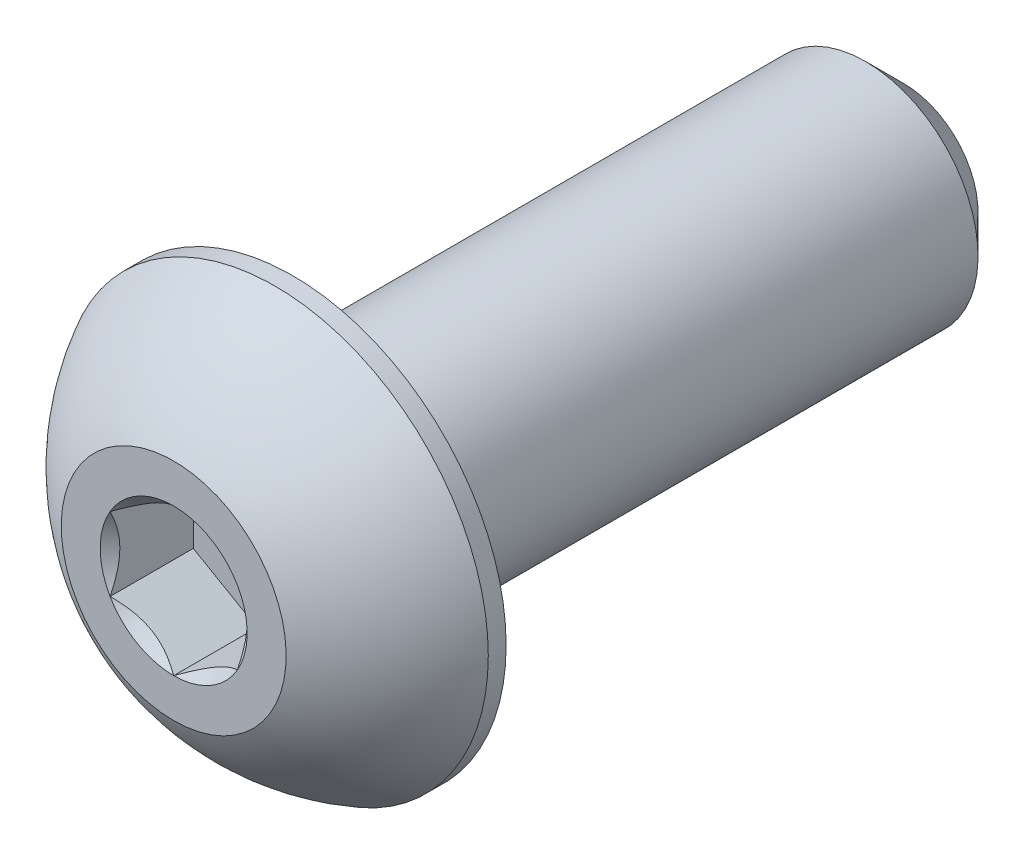
ISO-10303-21;
HEADER;
FILE_DESCRIPTION(('STEP AP214'),'2;1');
FILE_NAME('part.step','',(''),(''),'','','');
FILE_SCHEMA(('AUTOMOTIVE_DESIGN { 1 0 10303 214 1 1 1 1 }'));
ENDSEC;
DATA;
#1=APPLICATION_CONTEXT('core data for automotive mechanical design processes');
#2=APPLICATION_PROTOCOL_DEFINITION('international standard','automotive_design',2000,#1);
#3=PRODUCT_CONTEXT('',#1,'mechanical');
#4=PRODUCT('Part','Part','',(#3));
#5=PRODUCT_RELATED_PRODUCT_CATEGORY('part','',(#4));
#6=PRODUCT_DEFINITION_FORMATION('','',#4);
#7=PRODUCT_DEFINITION_CONTEXT('part definition',#1,'design');
#8=PRODUCT_DEFINITION('design','',#6,#7);
#9=PRODUCT_DEFINITION_SHAPE('','',#8);
#10=(LENGTH_UNIT() NAMED_UNIT(*) SI_UNIT(.MILLI.,.METRE.));
#11=(NAMED_UNIT(*) PLANE_ANGLE_UNIT() SI_UNIT($,.RADIAN.));
#12=(NAMED_UNIT(*) SI_UNIT($,.STERADIAN.) SOLID_ANGLE_UNIT());
#13=UNCERTAINTY_MEASURE_WITH_UNIT(LENGTH_MEASURE(1.E-05),#10,'distance_accuracy_value','');
#14=(GEOMETRIC_REPRESENTATION_CONTEXT(3) GLOBAL_UNCERTAINTY_ASSIGNED_CONTEXT((#13)) GLOBAL_UNIT_ASSIGNED_CONTEXT((#10,
#11,#12)) REPRESENTATION_CONTEXT('',''));
#15=CARTESIAN_POINT('',(0.,0.,0.));
#16=DIRECTION('',(0.,0.,1.));
#17=DIRECTION('',(1.,0.,0.));
#18=AXIS2_PLACEMENT_3D('',#15,#16,#17);
#19=CARTESIAN_POINT('',(0.,-1.75260000000001,-11.3792));
#20=DIRECTION('',(0.,0.,-1.));
#21=DIRECTION('',(0.,1.,0.));
#22=AXIS2_PLACEMENT_3D('',#19,#20,#21);
#23=PLANE('',#22);
#24=CARTESIAN_POINT('',(0.,0.,-11.3792));
#25=DIRECTION('',(0.,0.,-1.));
#26=DIRECTION('',(0.,1.,0.));
#27=AXIS2_PLACEMENT_3D('',#24,#25,#26);
#28=CIRCLE('',#27,1.1572875);
#29=CARTESIAN_POINT('',(0.,1.1572875,-11.3792));
#30=VERTEX_POINT('',#29);
#31=EDGE_CURVE('E176',#30,#30,#28,.T.);
#32=ORIENTED_EDGE('',*,*,#31,.T.);
#33=EDGE_LOOP('',(#32));
#34=FACE_BOUND('',#33,.T.);
#35=ADVANCED_FACE('F36',(#34),#23,.T.);
#36=CARTESIAN_POINT('',(0.,0.,-11.3792));
#37=DIRECTION('',(0.,0.,-1.));
#38=DIRECTION('',(0.,1.,0.));
#39=AXIS2_PLACEMENT_3D('',#36,#37,#38);
#40=CYLINDRICAL_SURFACE('',#39,1.7526);
#41=CARTESIAN_POINT('',(0.,0.,-10.7838875));
#42=DIRECTION('',(0.,0.,-1.));
#43=DIRECTION('',(0.,1.,0.));
#44=AXIS2_PLACEMENT_3D('',#41,#42,#43);
#45=CIRCLE('',#44,1.7526);
#46=CARTESIAN_POINT('',(0.,1.7526,-10.7838875));
#47=VERTEX_POINT('',#46);
#48=EDGE_CURVE('E50',#47,#47,#45,.F.);
#49=ORIENTED_EDGE('',*,*,#48,.T.);
#50=EDGE_LOOP('',(#49));
#51=FACE_BOUND('',#50,.T.);
#52=CARTESIAN_POINT('',(0.,0.,-1.8542));
#53=DIRECTION('',(0.,0.,1.));
#54=DIRECTION('',(1.,0.,0.));
#55=AXIS2_PLACEMENT_3D('',#52,#53,#54);
#56=CIRCLE('',#55,1.7526);
#57=CARTESIAN_POINT('',(1.7526,0.,-1.8542));
#58=VERTEX_POINT('',#57);
#59=EDGE_CURVE('E173',#58,#58,#56,.F.);
#60=ORIENTED_EDGE('',*,*,#59,.T.);
#61=EDGE_LOOP('',(#60));
#62=FACE_BOUND('',#61,.T.);
#63=ADVANCED_FACE('F181',(#51,#62),#40,.T.);
#64=CARTESIAN_POINT('',(0.,0.,-11.3792));
#65=DIRECTION('',(0.,0.,1.));
#66=DIRECTION('',(0.,-1.,0.));
#67=AXIS2_PLACEMENT_3D('',#64,#65,#66);
#68=CONICAL_SURFACE('',#67,1.1572875,0.785398163397445);
#69=ORIENTED_EDGE('',*,*,#48,.F.);
#70=EDGE_LOOP('',(#69));
#71=FACE_BOUND('',#70,.T.);
#72=ORIENTED_EDGE('',*,*,#31,.F.);
#73=EDGE_LOOP('',(#72));
#74=FACE_BOUND('',#73,.T.);
#75=ADVANCED_FACE('F38',(#71,#74),#68,.T.);
#76=CARTESIAN_POINT('',(0.,0.,-3.32598826349718));
#77=DIRECTION('',(0.,0.,1.));
#78=DIRECTION('',(0.,-1.,0.));
#79=AXIS2_PLACEMENT_3D('',#76,#77,#78);
#80=SPHERICAL_SURFACE('',#79,3.75949527050121);
#81=CARTESIAN_POINT('',(0.,0.,0.));
#82=DIRECTION('',(0.,0.,1.));
#83=DIRECTION('',(1.,0.,0.));
#84=AXIS2_PLACEMENT_3D('',#81,#82,#83);
#85=CIRCLE('',#84,1.7526);
#86=CARTESIAN_POINT('',(0.,-1.7526,0.));
#87=VERTEX_POINT('',#86);
#88=EDGE_CURVE('E170',#87,#87,#85,.T.);
#89=CARTESIAN_POINT('',(0.,0.,-1.57607));
#90=DIRECTION('',(0.,0.,1.));
#91=DIRECTION('',(1.,0.,0.));
#92=AXIS2_PLACEMENT_3D('',#89,#90,#91);
#93=CIRCLE('',#92,3.3274);
#94=CARTESIAN_POINT('',(0.,-3.3274,-1.57607));
#95=VERTEX_POINT('',#94);
#96=EDGE_CURVE('E164',#95,#95,#93,.T.);
#97=CARTESIAN_POINT('',(0.,-1.7526,0.));
#98=CARTESIAN_POINT('',(0.,-1.77344521091166,-0.0109841671242036));
#99=CARTESIAN_POINT('',(0.,-1.79418713228591,-0.022164349509344));
#100=CARTESIAN_POINT('',(0.,-1.83545712312919,-0.0449126843404111));
#101=CARTESIAN_POINT('',(0.,-1.85598519259822,-0.0564808367863379));
#102=CARTESIAN_POINT('',(0.,-1.89682020680057,-0.0800010512778902));
#103=CARTESIAN_POINT('',(0.,-1.9171271515339,-0.0919531133235157));
#104=CARTESIAN_POINT('',(0.,-1.95751274186056,-0.116236914088468));
#105=CARTESIAN_POINT('',(0.,-1.97759138745388,-0.128568652807795));
#106=CARTESIAN_POINT('',(0.,-2.01751328037423,-0.15360744962207));
#107=CARTESIAN_POINT('',(0.,-2.03735652770125,-0.166314507717019));
#108=CARTESIAN_POINT('',(0.,-2.07680060963244,-0.192099450667238));
#109=CARTESIAN_POINT('',(0.,-2.09640144423661,-0.205177335522508));
#110=CARTESIAN_POINT('',(0.,-2.13535377157089,-0.231699308994505));
#111=CARTESIAN_POINT('',(0.,-2.15470526430101,-0.245143397611231));
#112=CARTESIAN_POINT('',(0.,-2.19315206698496,-0.27239302596156));
#113=CARTESIAN_POINT('',(0.,-2.2122473769388,-0.286198565695162));
#114=CARTESIAN_POINT('',(0.,-2.25017506370288,-0.314166215909251));
#115=CARTESIAN_POINT('',(0.,-2.26900744051313,-0.328328326389736));
#116=CARTESIAN_POINT('',(0.,-2.30640260357941,-0.357004111663073));
#117=CARTESIAN_POINT('',(0.,-2.32496538983544,-0.371517786455924));
#118=CARTESIAN_POINT('',(0.,-2.36181480968332,-0.400891569642019));
#119=CARTESIAN_POINT('',(0.,-2.38010144327516,-0.415751678035262));
#120=CARTESIAN_POINT('',(0.,-2.41639209330763,-0.44581307524184));
#121=CARTESIAN_POINT('',(0.,-2.43439610974826,-0.461014364055174));
#122=CARTESIAN_POINT('',(0.,-2.47011516089881,-0.491752748311591));
#123=CARTESIAN_POINT('',(0.,-2.48783019560872,-0.507289843754673));
#124=CARTESIAN_POINT('',(0.,-2.52296502087599,-0.538694348769551));
#125=CARTESIAN_POINT('',(0.,-2.54038481143333,-0.554561758341348));
#126=CARTESIAN_POINT('',(0.,-2.57492299034501,-0.586621282343664));
#127=CARTESIAN_POINT('',(0.,-2.59204137869935,-0.602813396774184));
#128=CARTESIAN_POINT('',(0.,-2.62597070170293,-0.635516606437908));
#129=CARTESIAN_POINT('',(0.,-2.64278163635217,-0.652027701671111));
#130=CARTESIAN_POINT('',(0.,-2.67609010913108,-0.685363036121617));
#131=CARTESIAN_POINT('',(0.,-2.69258764726075,-0.702187275338921));
#132=CARTESIAN_POINT('',(0.,-2.72526349497449,-0.736142950239869));
#133=CARTESIAN_POINT('',(0.,-2.74144180455856,-0.753274385923514));
#134=CARTESIAN_POINT('',(0.,-2.7734734760052,-0.787838397642713));
#135=CARTESIAN_POINT('',(0.,-2.78932683786777,-0.805270973678268));
#136=CARTESIAN_POINT('',(0.,-2.82070300956741,-0.840431103531066));
#137=CARTESIAN_POINT('',(0.,-2.83622581940447,-0.85815865734831));
#138=CARTESIAN_POINT('',(0.,-2.86693539960216,-0.893902475917015));
#139=CARTESIAN_POINT('',(0.,-2.88212216996277,-0.911918740668476));
#140=CARTESIAN_POINT('',(0.,-2.91215430254962,-0.94823361219623));
#141=CARTESIAN_POINT('',(0.,-2.92699966477584,-0.966532218972523));
#142=CARTESIAN_POINT('',(0.,-2.95634373312651,-1.00340530583029));
#143=CARTESIAN_POINT('',(0.,-2.97084243925094,-1.02197978591176));
#144=CARTESIAN_POINT('',(0.,-2.99948806997761,-1.05939805313605));
#145=CARTESIAN_POINT('',(0.,-3.01363499457984,-1.07824184027885));
#146=CARTESIAN_POINT('',(0.,-3.04157206119591,-1.11619206018152));
#147=CARTESIAN_POINT('',(0.,-3.05536220320976,-1.13529849294138));
#148=CARTESIAN_POINT('',(0.,-3.08258082972231,-1.17376724977885));
#149=CARTESIAN_POINT('',(0.,-3.09600931422102,-1.19312957385645));
#150=CARTESIAN_POINT('',(0.,-3.12249987857489,-1.23210326859816));
#151=CARTESIAN_POINT('',(0.,-3.13556195843005,-1.25171463926226));
#152=CARTESIAN_POINT('',(0.,-3.16131509608524,-1.29117949430132));
#153=CARTESIAN_POINT('',(0.,-3.17400615388527,-1.31103297867626));
#154=CARTESIAN_POINT('',(0.,-3.19901276047088,-1.3509750430611));
#155=CARTESIAN_POINT('',(0.,-3.21132830925647,-1.37106362307099));
#156=CARTESIAN_POINT('',(0.,-3.23557954623934,-1.4114687760892));
#157=CARTESIAN_POINT('',(0.,-3.24751523443662,-1.43178534909752));
#158=CARTESIAN_POINT('',(0.,-3.27100252310173,-1.47263931029833));
#159=CARTESIAN_POINT('',(0.,-3.28255412356956,-1.49317669849081));
#160=CARTESIAN_POINT('',(0.,-3.30526918217882,-1.53446501395862));
#161=CARTESIAN_POINT('',(0.,-3.31643264032025,-1.55521594123393));
#162=CARTESIAN_POINT('',(0.,-3.3274,-1.57607));
#163=B_SPLINE_CURVE_WITH_KNOTS('',3,(#97,#98,#99,#100,#101,#102,#103,#104,#105,#106,#107,#108,
#109,#110,#111,#112,#113,#114,#115,#116,#117,#118,#119,#120,#121,#122,#123,#124,#125,#126,#127,
#128,#129,#130,#131,#132,#133,#134,#135,#136,#137,#138,#139,#140,#141,#142,#143,#144,#145,#146,
#147,#148,#149,#150,#151,#152,#153,#154,#155,#156,#157,#158,#159,#160,#161,#162),.UNSPECIFIED.,
.F.,.F.,(4,2,2,2,2,2,2,2,2,2,2,2,2,2,2,2,2,2,2,2,2,2,2,2,2,2,2,2,2,2,2,2,4),(0.,
0.0706853966104395,0.141370793220879,0.212056189831318,0.282741586441757,0.353426983052197,
0.424112379662636,0.494797776273076,0.565483172883515,0.636168569493955,0.706853966104394,
0.777539362714834,0.848224759325273,0.918910155935712,0.989595552546151,1.06028094915659,
1.13096634576703,1.20165174237747,1.27233713898791,1.34302253559835,1.41370793220879,
1.48439332881923,1.55507872542967,1.62576412204011,1.69644951865055,1.76713491526098,
1.83782031187142,1.90850570848186,1.9791911050923,2.04987650170274,2.12056189831318,
2.19124729492362,2.26193269153406),.UNSPECIFIED.);
#164=EDGE_CURVE('BSEAM186',#87,#95,#163,.T.);
#165=ORIENTED_EDGE('',*,*,#88,.F.);
#166=ORIENTED_EDGE('',*,*,#96,.T.);
#167=ORIENTED_EDGE('',*,*,#164,.T.);
#168=ORIENTED_EDGE('',*,*,#164,.F.);
#169=EDGE_LOOP('',(#165,#167,#166,#168));
#170=FACE_BOUND('',#169,.T.);
#171=ADVANCED_FACE('F186',(#170),#80,.T.);
#172=CARTESIAN_POINT('',(0.,-1.7526,0.));
#173=DIRECTION('',(0.,0.,-1.));
#174=DIRECTION('',(-1.,0.,0.));
#175=AXIS2_PLACEMENT_3D('',#172,#173,#174);
#176=PLANE('',#175);
#177=CARTESIAN_POINT('',(0.,0.,0.));
#178=DIRECTION('',(0.,0.,1.));
#179=DIRECTION('',(1.,0.,0.));
#180=AXIS2_PLACEMENT_3D('',#177,#178,#179);
#181=CIRCLE('',#180,1.14567944042316);
#182=CARTESIAN_POINT('',(-0.9921875,0.572839720211582,0.));
#183=VERTEX_POINT('',#182);
#184=CARTESIAN_POINT('',(-0.9921875,-0.572839720211582,0.));
#185=VERTEX_POINT('',#184);
#186=EDGE_CURVE('E63',#183,#185,#181,.T.);
#187=ORIENTED_EDGE('',*,*,#186,.F.);
#188=CARTESIAN_POINT('',(0.,1.14567944042316,0.));
#189=VERTEX_POINT('',#188);
#190=EDGE_CURVE('E135',#189,#183,#181,.T.);
#191=ORIENTED_EDGE('',*,*,#190,.F.);
#192=CARTESIAN_POINT('',(0.9921875,0.572839720211582,0.));
#193=VERTEX_POINT('',#192);
#194=EDGE_CURVE('E132',#193,#189,#181,.T.);
#195=ORIENTED_EDGE('',*,*,#194,.F.);
#196=CARTESIAN_POINT('',(0.9921875,-0.572839720211582,0.));
#197=VERTEX_POINT('',#196);
#198=EDGE_CURVE('E103',#197,#193,#181,.T.);
#199=ORIENTED_EDGE('',*,*,#198,.F.);
#200=CARTESIAN_POINT('',(0.,-1.14567944042316,0.));
#201=VERTEX_POINT('',#200);
#202=EDGE_CURVE('E95',#201,#197,#181,.T.);
#203=ORIENTED_EDGE('',*,*,#202,.F.);
#204=EDGE_CURVE('E56',#185,#201,#181,.T.);
#205=ORIENTED_EDGE('',*,*,#204,.F.);
#206=EDGE_LOOP('',(#187,#191,#195,#199,#203,#205));
#207=FACE_BOUND('',#206,.T.);
#208=ORIENTED_EDGE('',*,*,#88,.T.);
#209=EDGE_LOOP('',(#208));
#210=FACE_BOUND('',#209,.T.);
#211=ADVANCED_FACE('F129',(#207,#210),#176,.F.);
#212=CARTESIAN_POINT('',(0.,-3.3274,-1.8542));
#213=DIRECTION('',(0.,0.,1.));
#214=DIRECTION('',(1.,0.,0.));
#215=AXIS2_PLACEMENT_3D('',#212,#213,#214);
#216=PLANE('',#215);
#217=ORIENTED_EDGE('',*,*,#59,.F.);
#218=EDGE_LOOP('',(#217));
#219=FACE_BOUND('',#218,.T.);
#220=CARTESIAN_POINT('',(0.,0.,-1.8542));
#221=DIRECTION('',(0.,0.,1.));
#222=DIRECTION('',(1.,0.,0.));
#223=AXIS2_PLACEMENT_3D('',#220,#221,#222);
#224=CIRCLE('',#223,3.3274);
#225=CARTESIAN_POINT('',(3.3274,0.,-1.8542));
#226=VERTEX_POINT('',#225);
#227=EDGE_CURVE('E167',#226,#226,#224,.T.);
#228=ORIENTED_EDGE('',*,*,#227,.F.);
#229=EDGE_LOOP('',(#228));
#230=FACE_BOUND('',#229,.T.);
#231=ADVANCED_FACE('F200',(#219,#230),#216,.F.);
#232=CARTESIAN_POINT('',(0.,0.,0.));
#233=DIRECTION('',(0.,0.,1.));
#234=DIRECTION('',(1.,0.,0.));
#235=AXIS2_PLACEMENT_3D('',#232,#233,#234);
#236=CYLINDRICAL_SURFACE('',#235,3.3274);
#237=ORIENTED_EDGE('',*,*,#96,.F.);
#238=EDGE_LOOP('',(#237));
#239=FACE_BOUND('',#238,.T.);
#240=ORIENTED_EDGE('',*,*,#227,.T.);
#241=EDGE_LOOP('',(#240));
#242=FACE_BOUND('',#241,.T.);
#243=ADVANCED_FACE('F203',(#239,#242),#236,.T.);
#244=CARTESIAN_POINT('',(0.,0.,0.));
#245=DIRECTION('',(0.,0.,1.));
#246=DIRECTION('',(1.,0.,0.));
#247=AXIS2_PLACEMENT_3D('',#244,#245,#246);
#248=CONICAL_SURFACE('',#247,1.14567944042316,0.78539816339745);
#249=ORIENTED_EDGE('',*,*,#198,.T.);
#250=CARTESIAN_POINT('',(0.9921875,-1.14247621078911,0.367492039408284));
#251=CARTESIAN_POINT('',(0.9921875,-1.11465764801141,0.346491639249698));
#252=CARTESIAN_POINT('',(0.9921875,-1.08668408094051,0.325697147705785));
#253=CARTESIAN_POINT('',(0.9921875,-1.03036405365905,0.284605037686905));
#254=CARTESIAN_POINT('',(0.9921875,-1.00201750223733,0.264307544357067));
#255=CARTESIAN_POINT('',(0.9921875,-0.915909012346496,0.203998507493926));
#256=CARTESIAN_POINT('',(0.9921875,-0.857501195839067,0.164893852172636));
#257=CARTESIAN_POINT('',(0.9921875,-0.735022281240404,0.0881267527611405));
#258=CARTESIAN_POINT('',(0.9921875,-0.670818221894543,0.0506740309962608));
#259=CARTESIAN_POINT('',(0.9921875,-0.539203244212803,-0.0178349795389534));
#260=CARTESIAN_POINT('',(0.9921875,-0.471804118965061,-0.0489128317456888));
#261=CARTESIAN_POINT('',(0.9921875,-0.370637445252798,-0.0869337037637354));
#262=CARTESIAN_POINT('',(0.9921875,-0.338367677251603,-0.0978459676675487));
#263=CARTESIAN_POINT('',(0.9921875,-0.273049086247197,-0.117079769900667));
#264=CARTESIAN_POINT('',(0.9921875,-0.240000209742886,-0.125401129752807));
#265=CARTESIAN_POINT('',(0.9921875,-0.173878395816094,-0.138881226317852));
#266=CARTESIAN_POINT('',(0.9921875,-0.14081677471647,-0.144094606034908));
#267=CARTESIAN_POINT('',(0.9921875,-0.0743291671992143,-0.151260287542944));
#268=CARTESIAN_POINT('',(0.9921875,-0.0409031259919573,-0.153212091964575));
#269=CARTESIAN_POINT('',(0.9921875,0.0247631141129255,-0.153706514094286));
#270=CARTESIAN_POINT('',(0.9921875,0.0570024445003671,-0.152369968579246));
#271=CARTESIAN_POINT('',(0.9921875,0.121194220501071,-0.146628956786164));
#272=CARTESIAN_POINT('',(0.9921875,0.153146730366263,-0.142225195906134));
#273=CARTESIAN_POINT('',(0.9921875,0.217090524657736,-0.130515488840306));
#274=CARTESIAN_POINT('',(0.9921875,0.249072542149665,-0.123159697563355));
#275=CARTESIAN_POINT('',(0.9921875,0.312337779758396,-0.105936908614596));
#276=CARTESIAN_POINT('',(0.9921875,0.343621058108106,-0.0960701210649898));
#277=CARTESIAN_POINT('',(0.9921875,0.442112983138563,-0.0612938884031196));
#278=CARTESIAN_POINT('',(0.9921875,0.50791977119888,-0.0324238358491881));
#279=CARTESIAN_POINT('',(0.9921875,0.636441891183645,0.0317652099233282));
#280=CARTESIAN_POINT('',(0.9921875,0.699145053961295,0.0671073722096531));
#281=CARTESIAN_POINT('',(0.9921875,0.818979830095494,0.140021370867662));
#282=CARTESIAN_POINT('',(0.9921875,0.876233471712468,0.177395135048467));
#283=CARTESIAN_POINT('',(0.9921875,0.960585190784999,0.235171111904544));
#284=CARTESIAN_POINT('',(0.9921875,0.988338378424189,0.254633487670958));
#285=CARTESIAN_POINT('',(0.9921875,1.04346551341387,0.294072981771729));
#286=CARTESIAN_POINT('',(0.9921875,1.07083956239906,0.314049957884778));
#287=CARTESIAN_POINT('',(0.9921875,1.09805574523311,0.334240305642713));
#288=B_SPLINE_CURVE_WITH_KNOTS('',3,(#250,#251,#252,#253,#254,#255,#256,#257,#258,#259,#260,
#261,#262,#263,#264,#265,#266,#267,#268,#269,#270,#271,#272,#273,#274,#275,#276,#277,#278,#279,
#280,#281,#282,#283,#284,#285,#286,#287),.UNSPECIFIED.,.F.,.F.,(4,2,2,2,2,2,2,2,2,2,2,2,2,2,2,2,
2,2,4),(0.,0.104563127371702,0.209152318679108,0.419927098975113,0.642732653870156,
0.864771652131277,0.966879847039378,1.06899507422301,1.16925752982867,1.26953527342202,
1.36618351686957,1.46280954049584,1.56114078094885,1.65946379566813,1.87441437168727,
2.09015003608822,2.29516517576016,2.39685303378669,2.49851308339968),.UNSPECIFIED.);
#289=EDGE_CURVE('E11',#197,#193,#288,.T.);
#290=ORIENTED_EDGE('',*,*,#289,.F.);
#291=EDGE_LOOP('',(#249,#290));
#292=FACE_BOUND('',#291,.T.);
#293=ADVANCED_FACE('F107',(#292),#248,.F.);
#294=ORIENTED_EDGE('',*,*,#194,.T.);
#295=CARTESIAN_POINT('',(0.9923875,0.572724250157744,0.000115487508968476));
#296=CARTESIAN_POINT('',(0.958273424767844,0.592420020676185,-0.0195671885953467));
#297=CARTESIAN_POINT('',(0.92358891050772,0.612445134320978,-0.0380943154815883));
#298=CARTESIAN_POINT('',(0.85286291880004,0.653278804672111,-0.0720176703495943));
#299=CARTESIAN_POINT('',(0.816814708375757,0.674091248664375,-0.0873950127690516));
#300=CARTESIAN_POINT('',(0.744124988262604,0.716058678139022,-0.113736857265722));
#301=CARTESIAN_POINT('',(0.707502010986798,0.737202963927734,-0.124767603486859));
#302=CARTESIAN_POINT('',(0.633449993753943,0.779956916011158,-0.141763794327058));
#303=CARTESIAN_POINT('',(0.596023217440657,0.801565275390534,-0.147741932421081));
#304=CARTESIAN_POINT('',(0.531522861394528,0.838804573316593,-0.153133655085706));
#305=CARTESIAN_POINT('',(0.50453320068547,0.854387061192304,-0.153931003611658));
#306=CARTESIAN_POINT('',(0.450606144054335,0.885521861854894,-0.152591806638577));
#307=CARTESIAN_POINT('',(0.42366876097576,0.901074167226574,-0.150454613862953));
#308=CARTESIAN_POINT('',(0.343241277041502,0.947508996726262,-0.139782428693979));
#309=CARTESIAN_POINT('',(0.290151430636716,0.978160433839301,-0.126985619277286));
#310=CARTESIAN_POINT('',(0.196972862034202,1.03195710550467,-0.0961025323498721));
#311=CARTESIAN_POINT('',(0.156447193690483,1.055354611032,-0.0796349910922946));
#312=CARTESIAN_POINT('',(0.0769831842917924,1.10123317824922,-0.042539616443191));
#313=CARTESIAN_POINT('',(0.0380401617384762,1.12371694280344,-0.0219253193544625));
#314=CARTESIAN_POINT('',(-0.000200000000000225,1.145794910477,0.000115487508968402));
#315=B_SPLINE_CURVE_WITH_KNOTS('',3,(#295,#296,#297,#298,#299,#300,#301,#302,#303,#304,#305,
#306,#307,#308,#309,#310,#311,#312,#313,#314),.UNSPECIFIED.,.F.,.F.,(4,2,2,2,2,2,2,2,2,4),(0.,
0.132197185210191,0.265165186853263,0.39602009760567,0.526545281028575,0.619935205043265,
0.713345731536165,0.90022005184637,1.04884529769095,1.1969930355767),.UNSPECIFIED.);
#316=EDGE_CURVE('E134',#193,#189,#315,.T.);
#317=ORIENTED_EDGE('',*,*,#316,.F.);
#318=EDGE_LOOP('',(#294,#317));
#319=FACE_BOUND('',#318,.T.);
#320=ADVANCED_FACE('F288',(#319),#248,.F.);
#321=ORIENTED_EDGE('',*,*,#190,.T.);
#322=CARTESIAN_POINT('',(0.000199999999999742,1.145794910477,0.000115487508968564));
#323=CARTESIAN_POINT('',(-0.0339140752321562,1.12609913995856,-0.0195671885953466));
#324=CARTESIAN_POINT('',(-0.06859858949228,1.10607402631377,-0.0380943154815882));
#325=CARTESIAN_POINT('',(-0.13932458119996,1.06524035596264,-0.0720176703495941));
#326=CARTESIAN_POINT('',(-0.175372791624243,1.04442791197037,-0.0873950127690512));
#327=CARTESIAN_POINT('',(-0.248062511737396,1.00246048249572,-0.113736857265722));
#328=CARTESIAN_POINT('',(-0.284685489013202,0.981316196707012,-0.124767603486859));
#329=CARTESIAN_POINT('',(-0.358737506246057,0.938562244623588,-0.141763794327058));
#330=CARTESIAN_POINT('',(-0.396164282559343,0.916953885244212,-0.14774193242108));
#331=CARTESIAN_POINT('',(-0.460664638605471,0.879714587318153,-0.153133655085706));
#332=CARTESIAN_POINT('',(-0.48765429931453,0.864132099442442,-0.153931003611658));
#333=CARTESIAN_POINT('',(-0.541581355945664,0.832997298779852,-0.152591806638578));
#334=CARTESIAN_POINT('',(-0.56851873902424,0.817444993408172,-0.150454613862953));
#335=CARTESIAN_POINT('',(-0.648946222958498,0.771010163908484,-0.139782428693979));
#336=CARTESIAN_POINT('',(-0.702036069363283,0.740358726795445,-0.126985619277287));
#337=CARTESIAN_POINT('',(-0.795214637965797,0.68656205513008,-0.0961025323498727));
#338=CARTESIAN_POINT('',(-0.835740306309516,0.663164549602744,-0.0796349910922951));
#339=CARTESIAN_POINT('',(-0.915204315708207,0.617285982385523,-0.0425396164431913));
#340=CARTESIAN_POINT('',(-0.954147338261524,0.594802217831308,-0.0219253193544626));
#341=CARTESIAN_POINT('',(-0.9923875,0.572724250157744,0.000115487508968364));
#342=B_SPLINE_CURVE_WITH_KNOTS('',3,(#322,#323,#324,#325,#326,#327,#328,#329,#330,#331,#332,
#333,#334,#335,#336,#337,#338,#339,#340,#341),.UNSPECIFIED.,.F.,.F.,(4,2,2,2,2,2,2,2,2,4),(0.,
0.13219718521019,0.265165186853263,0.39602009760567,0.526545281028574,0.619935205043265,
0.713345731536164,0.900220051846369,1.04884529769095,1.1969930355767),.UNSPECIFIED.);
#343=EDGE_CURVE('E139',#189,#183,#342,.T.);
#344=ORIENTED_EDGE('',*,*,#343,.F.);
#345=EDGE_LOOP('',(#321,#344));
#346=FACE_BOUND('',#345,.T.);
#347=ADVANCED_FACE('F142',(#346),#248,.F.);
#348=ORIENTED_EDGE('',*,*,#186,.T.);
#349=CARTESIAN_POINT('',(-0.9921875,-1.14247621078911,0.367492039408284));
#350=CARTESIAN_POINT('',(-0.9921875,-1.11465764801141,0.346491639249698));
#351=CARTESIAN_POINT('',(-0.9921875,-1.08668408094051,0.325697147705785));
#352=CARTESIAN_POINT('',(-0.9921875,-1.03036405365905,0.284605037686905));
#353=CARTESIAN_POINT('',(-0.9921875,-1.00201750223733,0.264307544357067));
#354=CARTESIAN_POINT('',(-0.9921875,-0.915909012346497,0.203998507493926));
#355=CARTESIAN_POINT('',(-0.9921875,-0.857501195839067,0.164893852172636));
#356=CARTESIAN_POINT('',(-0.9921875,-0.735022281240404,0.0881267527611403));
#357=CARTESIAN_POINT('',(-0.9921875,-0.670818221894543,0.0506740309962608));
#358=CARTESIAN_POINT('',(-0.9921875,-0.539203244212803,-0.0178349795389533));
#359=CARTESIAN_POINT('',(-0.9921875,-0.471804118965062,-0.0489128317456888));
#360=CARTESIAN_POINT('',(-0.9921875,-0.370637445252798,-0.0869337037637354));
#361=CARTESIAN_POINT('',(-0.9921875,-0.338367677251604,-0.0978459676675487));
#362=CARTESIAN_POINT('',(-0.9921875,-0.273049086247197,-0.117079769900667));
#363=CARTESIAN_POINT('',(-0.9921875,-0.240000209742887,-0.125401129752807));
#364=CARTESIAN_POINT('',(-0.9921875,-0.173878395816094,-0.138881226317852));
#365=CARTESIAN_POINT('',(-0.9921875,-0.140816774716471,-0.144094606034908));
#366=CARTESIAN_POINT('',(-0.9921875,-0.0743291671992143,-0.151260287542943));
#367=CARTESIAN_POINT('',(-0.9921875,-0.0409031259919574,-0.153212091964575));
#368=CARTESIAN_POINT('',(-0.9921875,0.0247631141129254,-0.153706514094286));
#369=CARTESIAN_POINT('',(-0.9921875,0.057002444500367,-0.152369968579246));
#370=CARTESIAN_POINT('',(-0.9921875,0.121194220501071,-0.146628956786164));
#371=CARTESIAN_POINT('',(-0.9921875,0.153146730366263,-0.142225195906133));
#372=CARTESIAN_POINT('',(-0.9921875,0.217090524657736,-0.130515488840306));
#373=CARTESIAN_POINT('',(-0.9921875,0.249072542149665,-0.123159697563355));
#374=CARTESIAN_POINT('',(-0.9921875,0.312337779758396,-0.105936908614596));
#375=CARTESIAN_POINT('',(-0.9921875,0.343621058108106,-0.0960701210649898));
#376=CARTESIAN_POINT('',(-0.9921875,0.442112983138563,-0.0612938884031196));
#377=CARTESIAN_POINT('',(-0.9921875,0.50791977119888,-0.0324238358491881));
#378=CARTESIAN_POINT('',(-0.9921875,0.636441891183645,0.0317652099233281));
#379=CARTESIAN_POINT('',(-0.9921875,0.699145053961294,0.0671073722096529));
#380=CARTESIAN_POINT('',(-0.9921875,0.818979830095494,0.140021370867661));
#381=CARTESIAN_POINT('',(-0.9921875,0.876233471712468,0.177395135048466));
#382=CARTESIAN_POINT('',(-0.9921875,0.960585190784998,0.235171111904544));
#383=CARTESIAN_POINT('',(-0.9921875,0.988338378424189,0.254633487670958));
#384=CARTESIAN_POINT('',(-0.9921875,1.04346551341387,0.294072981771729));
#385=CARTESIAN_POINT('',(-0.9921875,1.07083956239906,0.314049957884777));
#386=CARTESIAN_POINT('',(-0.9921875,1.09805574523311,0.334240305642713));
#387=B_SPLINE_CURVE_WITH_KNOTS('',3,(#349,#350,#351,#352,#353,#354,#355,#356,#357,#358,#359,
#360,#361,#362,#363,#364,#365,#366,#367,#368,#369,#370,#371,#372,#373,#374,#375,#376,#377,#378,
#379,#380,#381,#382,#383,#384,#385,#386),.UNSPECIFIED.,.F.,.F.,(4,2,2,2,2,2,2,2,2,2,2,2,2,2,2,2,
2,2,4),(0.,0.104563127371703,0.209152318679108,0.419927098975114,0.642732653870156,
0.864771652131277,0.966879847039379,1.06899507422301,1.16925752982867,1.26953527342202,
1.36618351686957,1.46280954049584,1.56114078094885,1.65946379566813,1.87441437168727,
2.09015003608822,2.29516517576016,2.39685303378669,2.49851308339968),.UNSPECIFIED.);
#388=EDGE_CURVE('E146',#183,#185,#387,.F.);
#389=ORIENTED_EDGE('',*,*,#388,.F.);
#390=EDGE_LOOP('',(#348,#389));
#391=FACE_BOUND('',#390,.T.);
#392=ADVANCED_FACE('F282',(#391),#248,.F.);
#393=ORIENTED_EDGE('',*,*,#204,.T.);
#394=CARTESIAN_POINT('',(-0.9923875,-0.572724250157744,0.000115487508968476));
#395=CARTESIAN_POINT('',(-0.958273424767844,-0.592420020676184,-0.0195671885953467));
#396=CARTESIAN_POINT('',(-0.92358891050772,-0.612445134320978,-0.0380943154815883));
#397=CARTESIAN_POINT('',(-0.852862918800041,-0.65327880467211,-0.0720176703495943));
#398=CARTESIAN_POINT('',(-0.816814708375757,-0.674091248664375,-0.0873950127690515));
#399=CARTESIAN_POINT('',(-0.744124988262604,-0.716058678139022,-0.113736857265722));
#400=CARTESIAN_POINT('',(-0.707502010986798,-0.737202963927734,-0.124767603486859));
#401=CARTESIAN_POINT('',(-0.633449993753943,-0.779956916011158,-0.141763794327058));
#402=CARTESIAN_POINT('',(-0.596023217440657,-0.801565275390534,-0.147741932421081));
#403=CARTESIAN_POINT('',(-0.531522861394528,-0.838804573316593,-0.153133655085706));
#404=CARTESIAN_POINT('',(-0.50453320068547,-0.854387061192304,-0.153931003611658));
#405=CARTESIAN_POINT('',(-0.450606144054335,-0.885521861854894,-0.152591806638577));
#406=CARTESIAN_POINT('',(-0.42366876097576,-0.901074167226574,-0.150454613862953));
#407=CARTESIAN_POINT('',(-0.343241277041502,-0.947508996726262,-0.139782428693979));
#408=CARTESIAN_POINT('',(-0.290151430636717,-0.9781604338393,-0.126985619277286));
#409=CARTESIAN_POINT('',(-0.196972862034202,-1.03195710550467,-0.0961025323498724));
#410=CARTESIAN_POINT('',(-0.156447193690483,-1.055354611032,-0.0796349910922948));
#411=CARTESIAN_POINT('',(-0.0769831842917923,-1.10123317824922,-0.0425396164431912));
#412=CARTESIAN_POINT('',(-0.0380401617384762,-1.12371694280344,-0.0219253193544626));
#413=CARTESIAN_POINT('',(0.000200000000000447,-1.145794910477,0.000115487508968309));
#414=B_SPLINE_CURVE_WITH_KNOTS('',3,(#394,#395,#396,#397,#398,#399,#400,#401,#402,#403,#404,
#405,#406,#407,#408,#409,#410,#411,#412,#413),.UNSPECIFIED.,.F.,.F.,(4,2,2,2,2,2,2,2,2,4),(0.,
0.13219718521019,0.265165186853263,0.39602009760567,0.526545281028575,0.619935205043265,
0.713345731536165,0.90022005184637,1.04884529769095,1.1969930355767),.UNSPECIFIED.);
#415=EDGE_CURVE('E119',#185,#201,#414,.T.);
#416=ORIENTED_EDGE('',*,*,#415,.F.);
#417=EDGE_LOOP('',(#393,#416));
#418=FACE_BOUND('',#417,.T.);
#419=ADVANCED_FACE('F230',(#418),#248,.F.);
#420=ORIENTED_EDGE('',*,*,#202,.T.);
#421=CARTESIAN_POINT('',(-0.000199999999999627,-1.145794910477,0.000115487508968564));
#422=CARTESIAN_POINT('',(0.0339140752321564,-1.12609913995856,-0.0195671885953466));
#423=CARTESIAN_POINT('',(0.0685985894922801,-1.10607402631377,-0.0380943154815882));
#424=CARTESIAN_POINT('',(0.13932458119996,-1.06524035596264,-0.072017670349594));
#425=CARTESIAN_POINT('',(0.175372791624243,-1.04442791197037,-0.0873950127690512));
#426=CARTESIAN_POINT('',(0.248062511737396,-1.00246048249572,-0.113736857265722));
#427=CARTESIAN_POINT('',(0.284685489013202,-0.981316196707012,-0.124767603486859));
#428=CARTESIAN_POINT('',(0.358737506246057,-0.938562244623588,-0.141763794327058));
#429=CARTESIAN_POINT('',(0.396164282559343,-0.916953885244212,-0.147741932421081));
#430=CARTESIAN_POINT('',(0.460664638605471,-0.879714587318153,-0.153133655085706));
#431=CARTESIAN_POINT('',(0.48765429931453,-0.864132099442442,-0.153931003611658));
#432=CARTESIAN_POINT('',(0.541581355945665,-0.832997298779852,-0.152591806638577));
#433=CARTESIAN_POINT('',(0.56851873902424,-0.817444993408172,-0.150454613862953));
#434=CARTESIAN_POINT('',(0.648946222958498,-0.771010163908484,-0.139782428693979));
#435=CARTESIAN_POINT('',(0.702036069363283,-0.740358726795445,-0.126985619277287));
#436=CARTESIAN_POINT('',(0.795214637965798,-0.686562055130079,-0.0961025323498725));
#437=CARTESIAN_POINT('',(0.835740306309517,-0.663164549602744,-0.079634991092295));
#438=CARTESIAN_POINT('',(0.915204315708207,-0.617285982385523,-0.0425396164431914));
#439=CARTESIAN_POINT('',(0.954147338261524,-0.594802217831308,-0.0219253193544627));
#440=CARTESIAN_POINT('',(0.9923875,-0.572724250157744,0.000115487508968282));
#441=B_SPLINE_CURVE_WITH_KNOTS('',3,(#421,#422,#423,#424,#425,#426,#427,#428,#429,#430,#431,
#432,#433,#434,#435,#436,#437,#438,#439,#440),.UNSPECIFIED.,.F.,.F.,(4,2,2,2,2,2,2,2,2,4),(0.,
0.13219718521019,0.265165186853263,0.39602009760567,0.526545281028574,0.619935205043265,
0.713345731536165,0.90022005184637,1.04884529769095,1.1969930355767),.UNSPECIFIED.);
#442=EDGE_CURVE('E99',#201,#197,#441,.T.);
#443=ORIENTED_EDGE('',*,*,#442,.F.);
#444=EDGE_LOOP('',(#420,#443));
#445=FACE_BOUND('',#444,.T.);
#446=ADVANCED_FACE('F97',(#445),#248,.F.);
#447=CARTESIAN_POINT('',(0.9921875,-0.572839720211582,-1.29794));
#448=DIRECTION('',(0.,0.,1.));
#449=DIRECTION('',(1.,0.,0.));
#450=AXIS2_PLACEMENT_3D('',#447,#448,#449);
#451=PLANE('',#450);
#452=DIRECTION('',(0.866025403784438,0.5,0.));
#453=VECTOR('',#452,1.);
#454=CARTESIAN_POINT('',(0.,-1.14567944042316,-1.29794));
#455=LINE('',#454,#453);
#456=CARTESIAN_POINT('',(0.,-1.14567944042316,-1.29794));
#457=VERTEX_POINT('',#456);
#458=CARTESIAN_POINT('',(0.9921875,-0.572839720211582,-1.29794));
#459=VERTEX_POINT('',#458);
#460=EDGE_CURVE('E118',#457,#459,#455,.T.);
#461=ORIENTED_EDGE('',*,*,#460,.T.);
#462=DIRECTION('',(0.,1.,0.));
#463=VECTOR('',#462,1.);
#464=CARTESIAN_POINT('',(0.9921875,-0.572839720211582,-1.29794));
#465=LINE('',#464,#463);
#466=CARTESIAN_POINT('',(0.9921875,0.572839720211582,-1.29794));
#467=VERTEX_POINT('',#466);
#468=EDGE_CURVE('E123',#459,#467,#465,.T.);
#469=ORIENTED_EDGE('',*,*,#468,.T.);
#470=DIRECTION('',(-0.866025403784439,0.5,0.));
#471=VECTOR('',#470,1.);
#472=CARTESIAN_POINT('',(0.9921875,0.572839720211582,-1.29794));
#473=LINE('',#472,#471);
#474=CARTESIAN_POINT('',(0.,1.14567944042316,-1.29794));
#475=VERTEX_POINT('',#474);
#476=EDGE_CURVE('E272',#467,#475,#473,.T.);
#477=ORIENTED_EDGE('',*,*,#476,.T.);
#478=DIRECTION('',(-0.866025403784438,-0.5,0.));
#479=VECTOR('',#478,1.);
#480=CARTESIAN_POINT('',(0.,1.14567944042316,-1.29794));
#481=LINE('',#480,#479);
#482=CARTESIAN_POINT('',(-0.9921875,0.572839720211582,-1.29794));
#483=VERTEX_POINT('',#482);
#484=EDGE_CURVE('E155',#475,#483,#481,.T.);
#485=ORIENTED_EDGE('',*,*,#484,.T.);
#486=DIRECTION('',(0.,-1.,0.));
#487=VECTOR('',#486,1.);
#488=CARTESIAN_POINT('',(-0.9921875,0.572839720211582,-1.29794));
#489=LINE('',#488,#487);
#490=CARTESIAN_POINT('',(-0.9921875,-0.572839720211582,-1.29794));
#491=VERTEX_POINT('',#490);
#492=EDGE_CURVE('E276',#483,#491,#489,.T.);
#493=ORIENTED_EDGE('',*,*,#492,.T.);
#494=DIRECTION('',(0.866025403784439,-0.5,0.));
#495=VECTOR('',#494,1.);
#496=CARTESIAN_POINT('',(-0.9921875,-0.572839720211582,-1.29794));
#497=LINE('',#496,#495);
#498=EDGE_CURVE('E126',#491,#457,#497,.T.);
#499=ORIENTED_EDGE('',*,*,#498,.T.);
#500=EDGE_LOOP('',(#461,#469,#477,#485,#493,#499));
#501=FACE_BOUND('',#500,.T.);
#502=ADVANCED_FACE('F229',(#501),#451,.T.);
#503=CARTESIAN_POINT('',(0.9921875,-0.572839720211582,-1.29794));
#504=DIRECTION('',(1.,0.,0.));
#505=DIRECTION('',(0.,0.,-1.));
#506=AXIS2_PLACEMENT_3D('',#503,#504,#505);
#507=PLANE('',#506);
#508=DIRECTION('',(0.,0.,1.));
#509=VECTOR('',#508,1.);
#510=CARTESIAN_POINT('',(0.9921875,-0.572839720211582,-1.29794));
#511=LINE('',#510,#509);
#512=EDGE_CURVE('E115',#459,#197,#511,.T.);
#513=ORIENTED_EDGE('',*,*,#512,.T.);
#514=ORIENTED_EDGE('',*,*,#289,.T.);
#515=DIRECTION('',(0.,0.,1.));
#516=VECTOR('',#515,1.);
#517=CARTESIAN_POINT('',(0.9921875,0.572839720211582,-1.29794));
#518=LINE('',#517,#516);
#519=EDGE_CURVE('E125',#467,#193,#518,.T.);
#520=ORIENTED_EDGE('',*,*,#519,.F.);
#521=ORIENTED_EDGE('',*,*,#468,.F.);
#522=EDGE_LOOP('',(#513,#514,#520,#521));
#523=FACE_BOUND('',#522,.T.);
#524=ADVANCED_FACE('F121',(#523),#507,.F.);
#525=CARTESIAN_POINT('',(0.9921875,0.572839720211582,-1.29794));
#526=DIRECTION('',(0.5,0.866025403784439,0.));
#527=DIRECTION('',(-0.866025403784439,0.5,0.));
#528=AXIS2_PLACEMENT_3D('',#525,#526,#527);
#529=PLANE('',#528);
#530=ORIENTED_EDGE('',*,*,#519,.T.);
#531=ORIENTED_EDGE('',*,*,#316,.T.);
#532=DIRECTION('',(0.,0.,1.));
#533=VECTOR('',#532,1.);
#534=CARTESIAN_POINT('',(0.,1.14567944042316,-1.29794));
#535=LINE('',#534,#533);
#536=EDGE_CURVE('E151',#475,#189,#535,.T.);
#537=ORIENTED_EDGE('',*,*,#536,.F.);
#538=ORIENTED_EDGE('',*,*,#476,.F.);
#539=EDGE_LOOP('',(#530,#531,#537,#538));
#540=FACE_BOUND('',#539,.T.);
#541=ADVANCED_FACE('F149',(#540),#529,.F.);
#542=CARTESIAN_POINT('',(0.,1.14567944042316,-1.29794));
#543=DIRECTION('',(-0.5,0.866025403784438,0.));
#544=DIRECTION('',(-0.866025403784438,-0.5,0.));
#545=AXIS2_PLACEMENT_3D('',#542,#543,#544);
#546=PLANE('',#545);
#547=ORIENTED_EDGE('',*,*,#536,.T.);
#548=ORIENTED_EDGE('',*,*,#343,.T.);
#549=DIRECTION('',(0.,0.,1.));
#550=VECTOR('',#549,1.);
#551=CARTESIAN_POINT('',(-0.9921875,0.572839720211582,-1.29794));
#552=LINE('',#551,#550);
#553=EDGE_CURVE('E157',#483,#183,#552,.T.);
#554=ORIENTED_EDGE('',*,*,#553,.F.);
#555=ORIENTED_EDGE('',*,*,#484,.F.);
#556=EDGE_LOOP('',(#547,#548,#554,#555));
#557=FACE_BOUND('',#556,.T.);
#558=ADVANCED_FACE('F153',(#557),#546,.F.);
#559=CARTESIAN_POINT('',(-0.9921875,0.572839720211582,-1.29794));
#560=DIRECTION('',(-1.,0.,0.));
#561=DIRECTION('',(0.,0.,1.));
#562=AXIS2_PLACEMENT_3D('',#559,#560,#561);
#563=PLANE('',#562);
#564=ORIENTED_EDGE('',*,*,#553,.T.);
#565=ORIENTED_EDGE('',*,*,#388,.T.);
#566=DIRECTION('',(0.,0.,1.));
#567=VECTOR('',#566,1.);
#568=CARTESIAN_POINT('',(-0.9921875,-0.572839720211582,-1.29794));
#569=LINE('',#568,#567);
#570=EDGE_CURVE('E159',#491,#185,#569,.T.);
#571=ORIENTED_EDGE('',*,*,#570,.F.);
#572=ORIENTED_EDGE('',*,*,#492,.F.);
#573=EDGE_LOOP('',(#564,#565,#571,#572));
#574=FACE_BOUND('',#573,.T.);
#575=ADVANCED_FACE('F251',(#574),#563,.F.);
#576=CARTESIAN_POINT('',(-0.9921875,-0.572839720211582,-1.29794));
#577=DIRECTION('',(-0.5,-0.866025403784439,0.));
#578=DIRECTION('',(0.866025403784439,-0.5,0.));
#579=AXIS2_PLACEMENT_3D('',#576,#577,#578);
#580=PLANE('',#579);
#581=ORIENTED_EDGE('',*,*,#570,.T.);
#582=ORIENTED_EDGE('',*,*,#415,.T.);
#583=DIRECTION('',(0.,0.,1.));
#584=VECTOR('',#583,1.);
#585=CARTESIAN_POINT('',(0.,-1.14567944042316,-1.29794));
#586=LINE('',#585,#584);
#587=EDGE_CURVE('E117',#457,#201,#586,.T.);
#588=ORIENTED_EDGE('',*,*,#587,.F.);
#589=ORIENTED_EDGE('',*,*,#498,.F.);
#590=EDGE_LOOP('',(#581,#582,#588,#589));
#591=FACE_BOUND('',#590,.T.);
#592=ADVANCED_FACE('F210',(#591),#580,.F.);
#593=CARTESIAN_POINT('',(0.,-1.14567944042316,-1.29794));
#594=DIRECTION('',(0.5,-0.866025403784438,0.));
#595=DIRECTION('',(0.866025403784438,0.5,0.));
#596=AXIS2_PLACEMENT_3D('',#593,#594,#595);
#597=PLANE('',#596);
#598=ORIENTED_EDGE('',*,*,#587,.T.);
#599=ORIENTED_EDGE('',*,*,#442,.T.);
#600=ORIENTED_EDGE('',*,*,#512,.F.);
#601=ORIENTED_EDGE('',*,*,#460,.F.);
#602=EDGE_LOOP('',(#598,#599,#600,#601));
#603=FACE_BOUND('',#602,.T.);
#604=ADVANCED_FACE('F113',(#603),#597,.F.);
#605=CLOSED_SHELL('',(#35,#63,#75,#171,#211,#231,#243,#293,#320,#347,#392,#419,#446,#502,#524,
#541,#558,#575,#592,#604));
#606=MANIFOLD_SOLID_BREP('B2',#605);
#607=ADVANCED_BREP_SHAPE_REPRESENTATION('',(#18,#606),#14);
#608=SHAPE_DEFINITION_REPRESENTATION(#9,#607);
ENDSEC;
END-ISO-10303-21;
